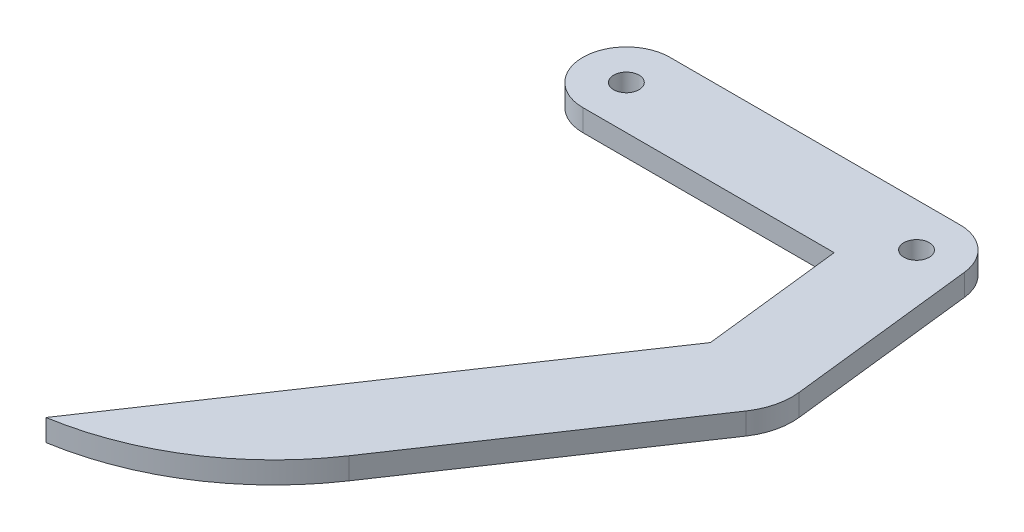
ISO-10303-21;
HEADER;
FILE_DESCRIPTION(('STEP AP214'),'2;1');
FILE_NAME('part.step','',(''),(''),'','','');
FILE_SCHEMA(('AUTOMOTIVE_DESIGN { 1 0 10303 214 1 1 1 1 }'));
ENDSEC;
DATA;
#1=APPLICATION_CONTEXT('core data for automotive mechanical design processes');
#2=APPLICATION_PROTOCOL_DEFINITION('international standard','automotive_design',2000,#1);
#3=PRODUCT_CONTEXT('',#1,'mechanical');
#4=PRODUCT('Part','Part','',(#3));
#5=PRODUCT_RELATED_PRODUCT_CATEGORY('part','',(#4));
#6=PRODUCT_DEFINITION_FORMATION('','',#4);
#7=PRODUCT_DEFINITION_CONTEXT('part definition',#1,'design');
#8=PRODUCT_DEFINITION('design','',#6,#7);
#9=PRODUCT_DEFINITION_SHAPE('','',#8);
#10=(LENGTH_UNIT() NAMED_UNIT(*) SI_UNIT(.MILLI.,.METRE.));
#11=(NAMED_UNIT(*) PLANE_ANGLE_UNIT() SI_UNIT($,.RADIAN.));
#12=(NAMED_UNIT(*) SI_UNIT($,.STERADIAN.) SOLID_ANGLE_UNIT());
#13=UNCERTAINTY_MEASURE_WITH_UNIT(LENGTH_MEASURE(1.E-05),#10,'distance_accuracy_value','');
#14=(GEOMETRIC_REPRESENTATION_CONTEXT(3) GLOBAL_UNCERTAINTY_ASSIGNED_CONTEXT((#13)) GLOBAL_UNIT_ASSIGNED_CONTEXT((#10,
#11,#12)) REPRESENTATION_CONTEXT('',''));
#15=CARTESIAN_POINT('',(0.,0.,0.));
#16=DIRECTION('',(0.,0.,1.));
#17=DIRECTION('',(1.,0.,0.));
#18=AXIS2_PLACEMENT_3D('',#15,#16,#17);
#19=CARTESIAN_POINT('',(37.0595691596372,3.,24.9471486520969));
#20=DIRECTION('',(0.829554483954362,0.,0.558425785714817));
#21=DIRECTION('',(0.558425785714817,0.,-0.829554483954363));
#22=AXIS2_PLACEMENT_3D('',#19,#20,#21);
#23=PLANE('',#22);
#24=DIRECTION('',(-0.558425785714817,0.,0.829554483954363));
#25=VECTOR('',#24,1.);
#26=CARTESIAN_POINT('',(37.0595691596372,0.,24.9471486520969));
#27=LINE('',#26,#25);
#28=CARTESIAN_POINT('',(36.8485666637555,0.,25.2605977639786));
#29=VERTEX_POINT('',#28);
#30=CARTESIAN_POINT('',(0.,0.,80.));
#31=VERTEX_POINT('',#30);
#32=EDGE_CURVE('E147',#29,#31,#27,.T.);
#33=ORIENTED_EDGE('',*,*,#32,.T.);
#34=DIRECTION('',(0.,-1.,0.));
#35=VECTOR('',#34,1.);
#36=CARTESIAN_POINT('',(0.,3.,80.));
#37=LINE('',#36,#35);
#38=CARTESIAN_POINT('',(0.,3.,80.));
#39=VERTEX_POINT('',#38);
#40=EDGE_CURVE('E11',#39,#31,#37,.T.);
#41=ORIENTED_EDGE('',*,*,#40,.F.);
#42=DIRECTION('',(-0.558425785714817,0.,0.829554483954363));
#43=VECTOR('',#42,1.);
#44=CARTESIAN_POINT('',(37.0595691596372,3.,24.9471486520969));
#45=LINE('',#44,#43);
#46=CARTESIAN_POINT('',(36.8485666637555,3.,25.2605977639786));
#47=VERTEX_POINT('',#46);
#48=EDGE_CURVE('E206',#47,#39,#45,.T.);
#49=ORIENTED_EDGE('',*,*,#48,.F.);
#50=DIRECTION('',(0.,-1.,0.));
#51=VECTOR('',#50,1.);
#52=CARTESIAN_POINT('',(36.8485666637555,3.,25.2605977639786));
#53=LINE('',#52,#51);
#54=EDGE_CURVE('E137',#47,#29,#53,.T.);
#55=ORIENTED_EDGE('',*,*,#54,.T.);
#56=EDGE_LOOP('',(#33,#41,#49,#55));
#57=FACE_BOUND('',#56,.T.);
#58=ADVANCED_FACE('F33',(#57),#23,.F.);
#59=CARTESIAN_POINT('',(-6.13133867123522,3.,42.4316018015633));
#60=DIRECTION('',(0.,-1.,0.));
#61=DIRECTION('',(0.,0.,-1.));
#62=AXIS2_PLACEMENT_3D('',#59,#60,#61);
#63=CYLINDRICAL_SURFACE('',#62,38.0654417693751);
#64=CARTESIAN_POINT('',(-6.13133867123522,0.,42.4316018015633));
#65=DIRECTION('',(0.,1.,0.));
#66=DIRECTION('',(0.,0.,1.));
#67=AXIS2_PLACEMENT_3D('',#64,#65,#66);
#68=CIRCLE('',#67,38.0654417693751);
#69=CARTESIAN_POINT('',(25.4460192322535,0.,63.6883260302082));
#70=VERTEX_POINT('',#69);
#71=EDGE_CURVE('E150',#31,#70,#68,.T.);
#72=ORIENTED_EDGE('',*,*,#71,.T.);
#73=DIRECTION('',(0.,-1.,0.));
#74=VECTOR('',#73,1.);
#75=CARTESIAN_POINT('',(25.4460192322535,3.,63.6883260302082));
#76=LINE('',#75,#74);
#77=CARTESIAN_POINT('',(25.4460192322535,3.,63.6883260302082));
#78=VERTEX_POINT('',#77);
#79=EDGE_CURVE('E42',#78,#70,#76,.T.);
#80=ORIENTED_EDGE('',*,*,#79,.F.);
#81=CARTESIAN_POINT('',(-6.13133867123522,3.,42.4316018015633));
#82=DIRECTION('',(0.,1.,0.));
#83=DIRECTION('',(0.,0.,1.));
#84=AXIS2_PLACEMENT_3D('',#81,#82,#83);
#85=CIRCLE('',#84,38.0654417693751);
#86=EDGE_CURVE('E99',#39,#78,#85,.T.);
#87=ORIENTED_EDGE('',*,*,#86,.F.);
#88=ORIENTED_EDGE('',*,*,#40,.T.);
#89=EDGE_LOOP('',(#72,#80,#87,#88));
#90=FACE_BOUND('',#89,.T.);
#91=ADVANCED_FACE('F188',(#90),#63,.T.);
#92=CARTESIAN_POINT('',(47.0142229670895,3.,31.6482580806747));
#93=DIRECTION('',(0.829554483954362,0.,0.558425785714817));
#94=DIRECTION('',(0.558425785714818,0.,-0.829554483954363));
#95=AXIS2_PLACEMENT_3D('',#92,#93,#94);
#96=PLANE('',#95);
#97=DIRECTION('',(-0.558425785714818,0.,0.829554483954362));
#98=VECTOR('',#97,1.);
#99=CARTESIAN_POINT('',(47.0142229670895,0.,31.6482580806747));
#100=LINE('',#99,#98);
#101=CARTESIAN_POINT('',(47.4761850400536,0.,30.9620026840804));
#102=VERTEX_POINT('',#101);
#103=EDGE_CURVE('E153',#102,#70,#100,.T.);
#104=ORIENTED_EDGE('',*,*,#103,.F.);
#105=DIRECTION('',(0.,-1.,0.));
#106=VECTOR('',#105,1.);
#107=CARTESIAN_POINT('',(47.4761850400536,3.,30.9620026840804));
#108=LINE('',#107,#106);
#109=CARTESIAN_POINT('',(47.4761850400536,3.,30.9620026840804));
#110=VERTEX_POINT('',#109);
#111=EDGE_CURVE('E181',#110,#102,#108,.T.);
#112=ORIENTED_EDGE('',*,*,#111,.F.);
#113=DIRECTION('',(-0.558425785714818,0.,0.829554483954362));
#114=VECTOR('',#113,1.);
#115=CARTESIAN_POINT('',(47.0142229670895,3.,31.6482580806747));
#116=LINE('',#115,#114);
#117=EDGE_CURVE('E187',#110,#78,#116,.T.);
#118=ORIENTED_EDGE('',*,*,#117,.T.);
#119=ORIENTED_EDGE('',*,*,#79,.T.);
#120=EDGE_LOOP('',(#104,#112,#118,#119));
#121=FACE_BOUND('',#120,.T.);
#122=ADVANCED_FACE('F185',(#121),#96,.T.);
#123=CARTESIAN_POINT('',(40.2336512892217,3.,26.0865934389936));
#124=DIRECTION('',(0.,-1.,0.));
#125=DIRECTION('',(0.,0.,-1.));
#126=AXIS2_PLACEMENT_3D('',#123,#124,#125);
#127=CYLINDRICAL_SURFACE('',#126,8.73063058656231);
#128=CARTESIAN_POINT('',(40.2336512892217,0.,26.0865934389936));
#129=DIRECTION('',(0.,1.,0.));
#130=DIRECTION('',(0.,0.,1.));
#131=AXIS2_PLACEMENT_3D('',#128,#129,#130);
#132=CIRCLE('',#131,8.73063058656231);
#133=CARTESIAN_POINT('',(48.907790247196,0.,25.0950170290436));
#134=VERTEX_POINT('',#133);
#135=EDGE_CURVE('E156',#102,#134,#132,.T.);
#136=ORIENTED_EDGE('',*,*,#135,.T.);
#137=DIRECTION('',(0.,-1.,0.));
#138=VECTOR('',#137,1.);
#139=CARTESIAN_POINT('',(48.907790247196,3.,25.0950170290436));
#140=LINE('',#139,#138);
#141=CARTESIAN_POINT('',(48.907790247196,3.,25.0950170290436));
#142=VERTEX_POINT('',#141);
#143=EDGE_CURVE('E179',#142,#134,#140,.T.);
#144=ORIENTED_EDGE('',*,*,#143,.F.);
#145=CARTESIAN_POINT('',(40.2336512892217,3.,26.0865934389936));
#146=DIRECTION('',(0.,1.,0.));
#147=DIRECTION('',(0.,0.,1.));
#148=AXIS2_PLACEMENT_3D('',#145,#146,#147);
#149=CIRCLE('',#148,8.73063058656231);
#150=EDGE_CURVE('E201',#110,#142,#149,.T.);
#151=ORIENTED_EDGE('',*,*,#150,.F.);
#152=ORIENTED_EDGE('',*,*,#111,.T.);
#153=EDGE_LOOP('',(#136,#144,#151,#152));
#154=FACE_BOUND('',#153,.T.);
#155=ADVANCED_FACE('F198',(#154),#127,.T.);
#156=CARTESIAN_POINT('',(45.4452108784525,3.,-5.19502849453988));
#157=DIRECTION('',(0.993529490449988,0.,-0.113574432009086));
#158=DIRECTION('',(-0.113574432009086,0.,-0.993529490449988));
#159=AXIS2_PLACEMENT_3D('',#156,#157,#158);
#160=PLANE('',#159);
#161=DIRECTION('',(0.113574432009086,0.,0.993529490449988));
#162=VECTOR('',#161,1.);
#163=CARTESIAN_POINT('',(45.4452108784525,0.,-5.19502849453988));
#164=LINE('',#163,#162);
#165=CARTESIAN_POINT('',(45.9611769427,0.,-0.681446592054516));
#166=VERTEX_POINT('',#165);
#167=EDGE_CURVE('E159',#166,#134,#164,.T.);
#168=ORIENTED_EDGE('',*,*,#167,.F.);
#169=DIRECTION('',(0.,-1.,0.));
#170=VECTOR('',#169,1.);
#171=CARTESIAN_POINT('',(45.9611769427,3.,-0.681446592054516));
#172=LINE('',#171,#170);
#173=CARTESIAN_POINT('',(45.9611769427,3.,-0.681446592054516));
#174=VERTEX_POINT('',#173);
#175=EDGE_CURVE('E177',#174,#166,#172,.T.);
#176=ORIENTED_EDGE('',*,*,#175,.F.);
#177=DIRECTION('',(0.113574432009086,0.,0.993529490449988));
#178=VECTOR('',#177,1.);
#179=CARTESIAN_POINT('',(45.4452108784525,3.,-5.19502849453988));
#180=LINE('',#179,#178);
#181=EDGE_CURVE('E203',#174,#142,#180,.T.);
#182=ORIENTED_EDGE('',*,*,#181,.T.);
#183=ORIENTED_EDGE('',*,*,#143,.T.);
#184=EDGE_LOOP('',(#168,#176,#182,#183));
#185=FACE_BOUND('',#184,.T.);
#186=ADVANCED_FACE('F305',(#185),#160,.T.);
#187=CARTESIAN_POINT('',(40.0000000000001,3.,0.));
#188=DIRECTION('',(0.,-1.,0.));
#189=DIRECTION('',(0.,0.,-1.));
#190=AXIS2_PLACEMENT_3D('',#187,#188,#189);
#191=CYLINDRICAL_SURFACE('',#190,6.);
#192=CARTESIAN_POINT('',(40.0000000000001,0.,0.));
#193=DIRECTION('',(0.,1.,0.));
#194=DIRECTION('',(0.,0.,1.));
#195=AXIS2_PLACEMENT_3D('',#192,#193,#194);
#196=CIRCLE('',#195,6.);
#197=CARTESIAN_POINT('',(40.0000000000002,0.,-6.));
#198=VERTEX_POINT('',#197);
#199=EDGE_CURVE('E162',#166,#198,#196,.T.);
#200=ORIENTED_EDGE('',*,*,#199,.T.);
#201=DIRECTION('',(0.,-1.,0.));
#202=VECTOR('',#201,1.);
#203=CARTESIAN_POINT('',(40.0000000000002,3.,-6.));
#204=LINE('',#203,#202);
#205=CARTESIAN_POINT('',(40.0000000000002,3.,-6.));
#206=VERTEX_POINT('',#205);
#207=EDGE_CURVE('E175',#206,#198,#204,.T.);
#208=ORIENTED_EDGE('',*,*,#207,.F.);
#209=CARTESIAN_POINT('',(40.0000000000001,3.,0.));
#210=DIRECTION('',(0.,1.,0.));
#211=DIRECTION('',(0.,0.,1.));
#212=AXIS2_PLACEMENT_3D('',#209,#210,#211);
#213=CIRCLE('',#212,6.);
#214=EDGE_CURVE('E211',#174,#206,#213,.T.);
#215=ORIENTED_EDGE('',*,*,#214,.F.);
#216=ORIENTED_EDGE('',*,*,#175,.T.);
#217=EDGE_LOOP('',(#200,#208,#215,#216));
#218=FACE_BOUND('',#217,.T.);
#219=ADVANCED_FACE('F296',(#218),#191,.T.);
#220=CARTESIAN_POINT('',(0.,3.,-6.));
#221=DIRECTION('',(0.,0.,-1.));
#222=DIRECTION('',(-1.,0.,0.));
#223=AXIS2_PLACEMENT_3D('',#220,#221,#222);
#224=PLANE('',#223);
#225=DIRECTION('',(1.,0.,0.));
#226=VECTOR('',#225,1.);
#227=CARTESIAN_POINT('',(0.,0.,-6.));
#228=LINE('',#227,#226);
#229=CARTESIAN_POINT('',(0.,0.,-6.));
#230=VERTEX_POINT('',#229);
#231=EDGE_CURVE('E165',#230,#198,#228,.T.);
#232=ORIENTED_EDGE('',*,*,#231,.F.);
#233=DIRECTION('',(0.,-1.,0.));
#234=VECTOR('',#233,1.);
#235=CARTESIAN_POINT('',(0.,3.,-6.));
#236=LINE('',#235,#234);
#237=CARTESIAN_POINT('',(0.,3.,-6.));
#238=VERTEX_POINT('',#237);
#239=EDGE_CURVE('E132',#238,#230,#236,.T.);
#240=ORIENTED_EDGE('',*,*,#239,.F.);
#241=DIRECTION('',(1.,0.,0.));
#242=VECTOR('',#241,1.);
#243=CARTESIAN_POINT('',(0.,3.,-6.));
#244=LINE('',#243,#242);
#245=EDGE_CURVE('E125',#238,#206,#244,.T.);
#246=ORIENTED_EDGE('',*,*,#245,.T.);
#247=ORIENTED_EDGE('',*,*,#207,.T.);
#248=EDGE_LOOP('',(#232,#240,#246,#247));
#249=FACE_BOUND('',#248,.T.);
#250=ADVANCED_FACE('F214',(#249),#224,.T.);
#251=CARTESIAN_POINT('',(0.,3.,0.));
#252=DIRECTION('',(0.,-1.,0.));
#253=DIRECTION('',(0.,0.,-1.));
#254=AXIS2_PLACEMENT_3D('',#251,#252,#253);
#255=CYLINDRICAL_SURFACE('',#254,6.);
#256=CARTESIAN_POINT('',(0.,0.,0.));
#257=DIRECTION('',(0.,1.,0.));
#258=DIRECTION('',(0.,0.,1.));
#259=AXIS2_PLACEMENT_3D('',#256,#257,#258);
#260=CIRCLE('',#259,6.);
#261=CARTESIAN_POINT('',(0.,0.,6.));
#262=VERTEX_POINT('',#261);
#263=EDGE_CURVE('E131',#230,#262,#260,.T.);
#264=ORIENTED_EDGE('',*,*,#263,.T.);
#265=DIRECTION('',(0.,-1.,0.));
#266=VECTOR('',#265,1.);
#267=CARTESIAN_POINT('',(0.,3.,6.));
#268=LINE('',#267,#266);
#269=CARTESIAN_POINT('',(0.,3.,6.));
#270=VERTEX_POINT('',#269);
#271=EDGE_CURVE('E128',#270,#262,#268,.T.);
#272=ORIENTED_EDGE('',*,*,#271,.F.);
#273=CARTESIAN_POINT('',(0.,3.,0.));
#274=DIRECTION('',(0.,1.,0.));
#275=DIRECTION('',(0.,0.,1.));
#276=AXIS2_PLACEMENT_3D('',#273,#274,#275);
#277=CIRCLE('',#276,6.);
#278=EDGE_CURVE('E119',#238,#270,#277,.T.);
#279=ORIENTED_EDGE('',*,*,#278,.F.);
#280=ORIENTED_EDGE('',*,*,#239,.T.);
#281=EDGE_LOOP('',(#264,#272,#279,#280));
#282=FACE_BOUND('',#281,.T.);
#283=ADVANCED_FACE('F129',(#282),#255,.T.);
#284=CARTESIAN_POINT('',(0.,3.,6.));
#285=DIRECTION('',(0.,0.,-1.));
#286=DIRECTION('',(-1.,0.,0.));
#287=AXIS2_PLACEMENT_3D('',#284,#285,#286);
#288=PLANE('',#287);
#289=DIRECTION('',(1.,0.,0.));
#290=VECTOR('',#289,1.);
#291=CARTESIAN_POINT('',(0.,0.,6.));
#292=LINE('',#291,#290);
#293=CARTESIAN_POINT('',(34.6468087167332,0.,6.));
#294=VERTEX_POINT('',#293);
#295=EDGE_CURVE('E85',#262,#294,#292,.T.);
#296=ORIENTED_EDGE('',*,*,#295,.T.);
#297=DIRECTION('',(0.,-1.,0.));
#298=VECTOR('',#297,1.);
#299=CARTESIAN_POINT('',(34.6468087167332,3.,6.));
#300=LINE('',#299,#298);
#301=CARTESIAN_POINT('',(34.6468087167332,3.,6.));
#302=VERTEX_POINT('',#301);
#303=EDGE_CURVE('E133',#302,#294,#300,.T.);
#304=ORIENTED_EDGE('',*,*,#303,.F.);
#305=DIRECTION('',(1.,0.,0.));
#306=VECTOR('',#305,1.);
#307=CARTESIAN_POINT('',(0.,3.,6.));
#308=LINE('',#307,#306);
#309=EDGE_CURVE('E123',#270,#302,#308,.T.);
#310=ORIENTED_EDGE('',*,*,#309,.F.);
#311=ORIENTED_EDGE('',*,*,#271,.T.);
#312=EDGE_LOOP('',(#296,#304,#310,#311));
#313=FACE_BOUND('',#312,.T.);
#314=ADVANCED_FACE('F135',(#313),#288,.F.);
#315=CARTESIAN_POINT('',(0.,3.,0.));
#316=DIRECTION('',(0.,-1.,0.));
#317=DIRECTION('',(0.,0.,-1.));
#318=AXIS2_PLACEMENT_3D('',#315,#316,#317);
#319=CYLINDRICAL_SURFACE('',#318,1.75);
#320=CARTESIAN_POINT('',(0.,3.,0.));
#321=DIRECTION('',(0.,1.,0.));
#322=DIRECTION('',(0.,0.,1.));
#323=AXIS2_PLACEMENT_3D('',#320,#321,#322);
#324=CIRCLE('',#323,1.75);
#325=CARTESIAN_POINT('',(0.,3.,1.75));
#326=VERTEX_POINT('',#325);
#327=EDGE_CURVE('E246',#326,#326,#324,.T.);
#328=ORIENTED_EDGE('',*,*,#327,.T.);
#329=EDGE_LOOP('',(#328));
#330=FACE_BOUND('',#329,.T.);
#331=CARTESIAN_POINT('',(0.,0.,0.));
#332=DIRECTION('',(0.,1.,0.));
#333=DIRECTION('',(0.,0.,1.));
#334=AXIS2_PLACEMENT_3D('',#331,#332,#333);
#335=CIRCLE('',#334,1.75);
#336=CARTESIAN_POINT('',(0.,0.,1.75));
#337=VERTEX_POINT('',#336);
#338=EDGE_CURVE('E144',#337,#337,#335,.T.);
#339=ORIENTED_EDGE('',*,*,#338,.F.);
#340=EDGE_LOOP('',(#339));
#341=FACE_BOUND('',#340,.T.);
#342=ADVANCED_FACE('F227',(#330,#341),#319,.F.);
#343=CARTESIAN_POINT('',(40.0000000000001,3.,0.));
#344=DIRECTION('',(0.,-1.,0.));
#345=DIRECTION('',(0.,0.,-1.));
#346=AXIS2_PLACEMENT_3D('',#343,#344,#345);
#347=CYLINDRICAL_SURFACE('',#346,1.75);
#348=CARTESIAN_POINT('',(40.0000000000001,3.,0.));
#349=DIRECTION('',(0.,1.,0.));
#350=DIRECTION('',(0.,0.,1.));
#351=AXIS2_PLACEMENT_3D('',#348,#349,#350);
#352=CIRCLE('',#351,1.75);
#353=CARTESIAN_POINT('',(40.0000000000001,3.,1.75));
#354=VERTEX_POINT('',#353);
#355=EDGE_CURVE('E171',#354,#354,#352,.T.);
#356=ORIENTED_EDGE('',*,*,#355,.T.);
#357=EDGE_LOOP('',(#356));
#358=FACE_BOUND('',#357,.T.);
#359=CARTESIAN_POINT('',(40.0000000000001,0.,0.));
#360=DIRECTION('',(0.,1.,0.));
#361=DIRECTION('',(0.,0.,1.));
#362=AXIS2_PLACEMENT_3D('',#359,#360,#361);
#363=CIRCLE('',#362,1.75);
#364=CARTESIAN_POINT('',(40.0000000000001,0.,1.75));
#365=VERTEX_POINT('',#364);
#366=EDGE_CURVE('E141',#365,#365,#363,.T.);
#367=ORIENTED_EDGE('',*,*,#366,.F.);
#368=EDGE_LOOP('',(#367));
#369=FACE_BOUND('',#368,.T.);
#370=ADVANCED_FACE('F35',(#358,#369),#347,.F.);
#371=CARTESIAN_POINT('',(33.5228569930527,3.,-3.83213531043086));
#372=DIRECTION('',(0.993529490449988,0.,-0.113574432009086));
#373=DIRECTION('',(-0.113574432009086,0.,-0.993529490449988));
#374=AXIS2_PLACEMENT_3D('',#371,#372,#373);
#375=PLANE('',#374);
#376=DIRECTION('',(0.113574432009086,0.,0.993529490449988));
#377=VECTOR('',#376,1.);
#378=CARTESIAN_POINT('',(33.5228569930527,0.,-3.83213531043086));
#379=LINE('',#378,#377);
#380=EDGE_CURVE('E91',#294,#29,#379,.T.);
#381=ORIENTED_EDGE('',*,*,#380,.T.);
#382=ORIENTED_EDGE('',*,*,#54,.F.);
#383=DIRECTION('',(0.113574432009086,0.,0.993529490449988));
#384=VECTOR('',#383,1.);
#385=CARTESIAN_POINT('',(33.5228569930527,3.,-3.83213531043086));
#386=LINE('',#385,#384);
#387=EDGE_CURVE('E50',#302,#47,#386,.T.);
#388=ORIENTED_EDGE('',*,*,#387,.F.);
#389=ORIENTED_EDGE('',*,*,#303,.T.);
#390=EDGE_LOOP('',(#381,#382,#388,#389));
#391=FACE_BOUND('',#390,.T.);
#392=ADVANCED_FACE('F218',(#391),#375,.F.);
#393=CARTESIAN_POINT('',(0.,3.,0.));
#394=DIRECTION('',(0.,1.,0.));
#395=DIRECTION('',(0.,0.,1.));
#396=AXIS2_PLACEMENT_3D('',#393,#394,#395);
#397=PLANE('',#396);
#398=ORIENTED_EDGE('',*,*,#355,.F.);
#399=EDGE_LOOP('',(#398));
#400=FACE_BOUND('',#399,.T.);
#401=ORIENTED_EDGE('',*,*,#327,.F.);
#402=EDGE_LOOP('',(#401));
#403=FACE_BOUND('',#402,.T.);
#404=ORIENTED_EDGE('',*,*,#48,.T.);
#405=ORIENTED_EDGE('',*,*,#86,.T.);
#406=ORIENTED_EDGE('',*,*,#117,.F.);
#407=ORIENTED_EDGE('',*,*,#150,.T.);
#408=ORIENTED_EDGE('',*,*,#181,.F.);
#409=ORIENTED_EDGE('',*,*,#214,.T.);
#410=ORIENTED_EDGE('',*,*,#245,.F.);
#411=ORIENTED_EDGE('',*,*,#278,.T.);
#412=ORIENTED_EDGE('',*,*,#309,.T.);
#413=ORIENTED_EDGE('',*,*,#387,.T.);
#414=EDGE_LOOP('',(#404,#405,#406,#407,#408,#409,#410,#411,#412,#413));
#415=FACE_BOUND('',#414,.T.);
#416=ADVANCED_FACE('F121',(#400,#403,#415),#397,.T.);
#417=CARTESIAN_POINT('',(0.,0.,0.));
#418=DIRECTION('',(0.,1.,0.));
#419=DIRECTION('',(0.,0.,1.));
#420=AXIS2_PLACEMENT_3D('',#417,#418,#419);
#421=PLANE('',#420);
#422=ORIENTED_EDGE('',*,*,#366,.T.);
#423=EDGE_LOOP('',(#422));
#424=FACE_BOUND('',#423,.T.);
#425=ORIENTED_EDGE('',*,*,#338,.T.);
#426=EDGE_LOOP('',(#425));
#427=FACE_BOUND('',#426,.T.);
#428=ORIENTED_EDGE('',*,*,#32,.F.);
#429=ORIENTED_EDGE('',*,*,#380,.F.);
#430=ORIENTED_EDGE('',*,*,#295,.F.);
#431=ORIENTED_EDGE('',*,*,#263,.F.);
#432=ORIENTED_EDGE('',*,*,#231,.T.);
#433=ORIENTED_EDGE('',*,*,#199,.F.);
#434=ORIENTED_EDGE('',*,*,#167,.T.);
#435=ORIENTED_EDGE('',*,*,#135,.F.);
#436=ORIENTED_EDGE('',*,*,#103,.T.);
#437=ORIENTED_EDGE('',*,*,#71,.F.);
#438=EDGE_LOOP('',(#428,#429,#430,#431,#432,#433,#434,#435,#436,#437));
#439=FACE_BOUND('',#438,.T.);
#440=ADVANCED_FACE('F193',(#424,#427,#439),#421,.F.);
#441=CLOSED_SHELL('',(#58,#91,#122,#155,#186,#219,#250,#283,#314,#342,#370,#392,#416,#440));
#442=MANIFOLD_SOLID_BREP('B2',#441);
#443=ADVANCED_BREP_SHAPE_REPRESENTATION('',(#18,#442),#14);
#444=SHAPE_DEFINITION_REPRESENTATION(#9,#443);
ENDSEC;
END-ISO-10303-21;
